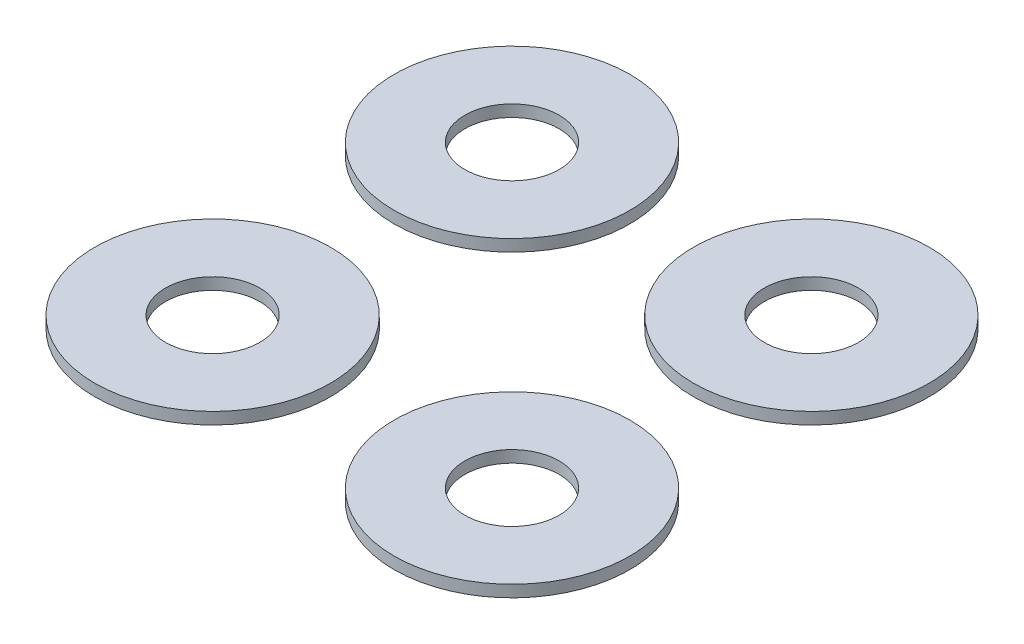
ISO-10303-21;
HEADER;
FILE_DESCRIPTION(('STEP AP214'),'2;1');
FILE_NAME('part.step','',(''),(''),'','','');
FILE_SCHEMA(('AUTOMOTIVE_DESIGN { 1 0 10303 214 1 1 1 1 }'));
ENDSEC;
DATA;
#1=APPLICATION_CONTEXT('core data for automotive mechanical design processes');
#2=APPLICATION_PROTOCOL_DEFINITION('international standard','automotive_design',2000,#1);
#3=PRODUCT_CONTEXT('',#1,'mechanical');
#4=PRODUCT('Part','Part','',(#3));
#5=PRODUCT_RELATED_PRODUCT_CATEGORY('part','',(#4));
#6=PRODUCT_DEFINITION_FORMATION('','',#4);
#7=PRODUCT_DEFINITION_CONTEXT('part definition',#1,'design');
#8=PRODUCT_DEFINITION('design','',#6,#7);
#9=PRODUCT_DEFINITION_SHAPE('','',#8);
#10=(LENGTH_UNIT() NAMED_UNIT(*) SI_UNIT(.MILLI.,.METRE.));
#11=(NAMED_UNIT(*) PLANE_ANGLE_UNIT() SI_UNIT($,.RADIAN.));
#12=(NAMED_UNIT(*) SI_UNIT($,.STERADIAN.) SOLID_ANGLE_UNIT());
#13=UNCERTAINTY_MEASURE_WITH_UNIT(LENGTH_MEASURE(1.E-05),#10,'distance_accuracy_value','');
#14=(GEOMETRIC_REPRESENTATION_CONTEXT(3) GLOBAL_UNCERTAINTY_ASSIGNED_CONTEXT((#13)) GLOBAL_UNIT_ASSIGNED_CONTEXT((#10,
#11,#12)) REPRESENTATION_CONTEXT('',''));
#15=CARTESIAN_POINT('',(0.,0.,0.));
#16=DIRECTION('',(0.,0.,1.));
#17=DIRECTION('',(1.,0.,0.));
#18=AXIS2_PLACEMENT_3D('',#15,#16,#17);
#19=CARTESIAN_POINT('',(2.54,0.1,-2.54));
#20=DIRECTION('',(0.,-1.,0.));
#21=DIRECTION('',(0.,0.,-1.));
#22=AXIS2_PLACEMENT_3D('',#19,#20,#21);
#23=CYLINDRICAL_SURFACE('',#22,1.);
#24=CARTESIAN_POINT('',(2.54,0.1,-2.54));
#25=DIRECTION('',(0.,-1.,0.));
#26=DIRECTION('',(0.,0.,-1.));
#27=AXIS2_PLACEMENT_3D('',#24,#25,#26);
#28=CIRCLE('',#27,1.);
#29=CARTESIAN_POINT('',(2.54,0.1,-3.54));
#30=VERTEX_POINT('',#29);
#31=EDGE_CURVE('P0_E19',#30,#30,#28,.F.);
#32=ORIENTED_EDGE('',*,*,#31,.F.);
#33=EDGE_LOOP('',(#32));
#34=FACE_BOUND('',#33,.T.);
#35=CARTESIAN_POINT('',(2.54,0.,-2.54));
#36=DIRECTION('',(0.,-1.,0.));
#37=DIRECTION('',(0.,0.,-1.));
#38=AXIS2_PLACEMENT_3D('',#35,#36,#37);
#39=CIRCLE('',#38,1.);
#40=CARTESIAN_POINT('',(2.54,0.,-3.54));
#41=VERTEX_POINT('',#40);
#42=EDGE_CURVE('P0_E28',#41,#41,#39,.F.);
#43=ORIENTED_EDGE('',*,*,#42,.T.);
#44=EDGE_LOOP('',(#43));
#45=FACE_BOUND('',#44,.T.);
#46=ADVANCED_FACE('P0_F15',(#34,#45),#23,.T.);
#47=CARTESIAN_POINT('',(1.528,0.1,-3.552));
#48=DIRECTION('',(0.,1.,0.));
#49=DIRECTION('',(0.,0.,1.));
#50=AXIS2_PLACEMENT_3D('',#47,#48,#49);
#51=PLANE('',#50);
#52=CARTESIAN_POINT('',(2.54,0.1,-2.54));
#53=DIRECTION('',(0.,-1.,0.));
#54=DIRECTION('',(0.,0.,-1.));
#55=AXIS2_PLACEMENT_3D('',#52,#53,#54);
#56=CIRCLE('',#55,0.4);
#57=CARTESIAN_POINT('',(2.54,0.1,-2.94));
#58=VERTEX_POINT('',#57);
#59=EDGE_CURVE('P0_E23',#58,#58,#56,.F.);
#60=ORIENTED_EDGE('',*,*,#59,.F.);
#61=EDGE_LOOP('',(#60));
#62=FACE_BOUND('',#61,.T.);
#63=ORIENTED_EDGE('',*,*,#31,.T.);
#64=EDGE_LOOP('',(#63));
#65=FACE_BOUND('',#64,.T.);
#66=ADVANCED_FACE('P0_F36',(#62,#65),#51,.T.);
#67=CARTESIAN_POINT('',(1.528,0.,-3.552));
#68=DIRECTION('',(0.,1.,0.));
#69=DIRECTION('',(0.,0.,1.));
#70=AXIS2_PLACEMENT_3D('',#67,#68,#69);
#71=PLANE('',#70);
#72=CARTESIAN_POINT('',(2.54,0.,-2.54));
#73=DIRECTION('',(0.,-1.,0.));
#74=DIRECTION('',(0.,0.,-1.));
#75=AXIS2_PLACEMENT_3D('',#72,#73,#74);
#76=CIRCLE('',#75,0.4);
#77=CARTESIAN_POINT('',(2.54,0.,-2.94));
#78=VERTEX_POINT('',#77);
#79=EDGE_CURVE('P0_E10',#78,#78,#76,.T.);
#80=ORIENTED_EDGE('',*,*,#79,.F.);
#81=EDGE_LOOP('',(#80));
#82=FACE_BOUND('',#81,.T.);
#83=ORIENTED_EDGE('',*,*,#42,.F.);
#84=EDGE_LOOP('',(#83));
#85=FACE_BOUND('',#84,.T.);
#86=ADVANCED_FACE('P0_F17',(#82,#85),#71,.F.);
#87=CARTESIAN_POINT('',(2.54,0.1,-2.54));
#88=DIRECTION('',(0.,-1.,0.));
#89=DIRECTION('',(0.,0.,-1.));
#90=AXIS2_PLACEMENT_3D('',#87,#88,#89);
#91=CYLINDRICAL_SURFACE('',#90,0.4);
#92=ORIENTED_EDGE('',*,*,#79,.T.);
#93=EDGE_LOOP('',(#92));
#94=FACE_BOUND('',#93,.T.);
#95=ORIENTED_EDGE('',*,*,#59,.T.);
#96=EDGE_LOOP('',(#95));
#97=FACE_BOUND('',#96,.T.);
#98=ADVANCED_FACE('P0_F46',(#94,#97),#91,.F.);
#99=CLOSED_SHELL('',(#46,#66,#86,#98));
#100=MANIFOLD_SOLID_BREP('P0_B1',#99);
#101=CARTESIAN_POINT('',(0.,0.1,-2.54));
#102=DIRECTION('',(0.,-1.,0.));
#103=DIRECTION('',(0.,0.,-1.));
#104=AXIS2_PLACEMENT_3D('',#101,#102,#103);
#105=CYLINDRICAL_SURFACE('',#104,1.);
#106=CARTESIAN_POINT('',(0.,0.1,-2.54));
#107=DIRECTION('',(0.,-1.,0.));
#108=DIRECTION('',(0.,0.,-1.));
#109=AXIS2_PLACEMENT_3D('',#106,#107,#108);
#110=CIRCLE('',#109,1.);
#111=CARTESIAN_POINT('',(0.,0.1,-3.54));
#112=VERTEX_POINT('',#111);
#113=EDGE_CURVE('P1_E19',#112,#112,#110,.F.);
#114=ORIENTED_EDGE('',*,*,#113,.F.);
#115=EDGE_LOOP('',(#114));
#116=FACE_BOUND('',#115,.T.);
#117=CARTESIAN_POINT('',(0.,0.,-2.54));
#118=DIRECTION('',(0.,-1.,0.));
#119=DIRECTION('',(0.,0.,-1.));
#120=AXIS2_PLACEMENT_3D('',#117,#118,#119);
#121=CIRCLE('',#120,1.);
#122=CARTESIAN_POINT('',(0.,0.,-3.54));
#123=VERTEX_POINT('',#122);
#124=EDGE_CURVE('P1_E28',#123,#123,#121,.F.);
#125=ORIENTED_EDGE('',*,*,#124,.T.);
#126=EDGE_LOOP('',(#125));
#127=FACE_BOUND('',#126,.T.);
#128=ADVANCED_FACE('P1_F15',(#116,#127),#105,.T.);
#129=CARTESIAN_POINT('',(-1.012,0.1,-3.552));
#130=DIRECTION('',(0.,1.,0.));
#131=DIRECTION('',(0.,0.,1.));
#132=AXIS2_PLACEMENT_3D('',#129,#130,#131);
#133=PLANE('',#132);
#134=CARTESIAN_POINT('',(0.,0.1,-2.54));
#135=DIRECTION('',(0.,-1.,0.));
#136=DIRECTION('',(0.,0.,-1.));
#137=AXIS2_PLACEMENT_3D('',#134,#135,#136);
#138=CIRCLE('',#137,0.4);
#139=CARTESIAN_POINT('',(0.,0.1,-2.94));
#140=VERTEX_POINT('',#139);
#141=EDGE_CURVE('P1_E23',#140,#140,#138,.F.);
#142=ORIENTED_EDGE('',*,*,#141,.F.);
#143=EDGE_LOOP('',(#142));
#144=FACE_BOUND('',#143,.T.);
#145=ORIENTED_EDGE('',*,*,#113,.T.);
#146=EDGE_LOOP('',(#145));
#147=FACE_BOUND('',#146,.T.);
#148=ADVANCED_FACE('P1_F36',(#144,#147),#133,.T.);
#149=CARTESIAN_POINT('',(-1.012,0.,-3.552));
#150=DIRECTION('',(0.,1.,0.));
#151=DIRECTION('',(0.,0.,1.));
#152=AXIS2_PLACEMENT_3D('',#149,#150,#151);
#153=PLANE('',#152);
#154=CARTESIAN_POINT('',(0.,0.,-2.54));
#155=DIRECTION('',(0.,-1.,0.));
#156=DIRECTION('',(0.,0.,-1.));
#157=AXIS2_PLACEMENT_3D('',#154,#155,#156);
#158=CIRCLE('',#157,0.4);
#159=CARTESIAN_POINT('',(0.,0.,-2.94));
#160=VERTEX_POINT('',#159);
#161=EDGE_CURVE('P1_E10',#160,#160,#158,.T.);
#162=ORIENTED_EDGE('',*,*,#161,.F.);
#163=EDGE_LOOP('',(#162));
#164=FACE_BOUND('',#163,.T.);
#165=ORIENTED_EDGE('',*,*,#124,.F.);
#166=EDGE_LOOP('',(#165));
#167=FACE_BOUND('',#166,.T.);
#168=ADVANCED_FACE('P1_F17',(#164,#167),#153,.F.);
#169=CARTESIAN_POINT('',(0.,0.1,-2.54));
#170=DIRECTION('',(0.,-1.,0.));
#171=DIRECTION('',(0.,0.,-1.));
#172=AXIS2_PLACEMENT_3D('',#169,#170,#171);
#173=CYLINDRICAL_SURFACE('',#172,0.4);
#174=ORIENTED_EDGE('',*,*,#161,.T.);
#175=EDGE_LOOP('',(#174));
#176=FACE_BOUND('',#175,.T.);
#177=ORIENTED_EDGE('',*,*,#141,.T.);
#178=EDGE_LOOP('',(#177));
#179=FACE_BOUND('',#178,.T.);
#180=ADVANCED_FACE('P1_F46',(#176,#179),#173,.F.);
#181=CLOSED_SHELL('',(#128,#148,#168,#180));
#182=MANIFOLD_SOLID_BREP('P1_B1',#181);
#183=CARTESIAN_POINT('',(0.,0.1,0.));
#184=DIRECTION('',(0.,-1.,0.));
#185=DIRECTION('',(0.,0.,-1.));
#186=AXIS2_PLACEMENT_3D('',#183,#184,#185);
#187=CYLINDRICAL_SURFACE('',#186,1.);
#188=CARTESIAN_POINT('',(0.,0.1,0.));
#189=DIRECTION('',(0.,-1.,0.));
#190=DIRECTION('',(0.,0.,-1.));
#191=AXIS2_PLACEMENT_3D('',#188,#189,#190);
#192=CIRCLE('',#191,1.);
#193=CARTESIAN_POINT('',(0.,0.1,-1.));
#194=VERTEX_POINT('',#193);
#195=EDGE_CURVE('P2_E19',#194,#194,#192,.F.);
#196=ORIENTED_EDGE('',*,*,#195,.F.);
#197=EDGE_LOOP('',(#196));
#198=FACE_BOUND('',#197,.T.);
#199=CARTESIAN_POINT('',(0.,0.,0.));
#200=DIRECTION('',(0.,-1.,0.));
#201=DIRECTION('',(0.,0.,-1.));
#202=AXIS2_PLACEMENT_3D('',#199,#200,#201);
#203=CIRCLE('',#202,1.);
#204=CARTESIAN_POINT('',(0.,0.,-1.));
#205=VERTEX_POINT('',#204);
#206=EDGE_CURVE('P2_E28',#205,#205,#203,.F.);
#207=ORIENTED_EDGE('',*,*,#206,.T.);
#208=EDGE_LOOP('',(#207));
#209=FACE_BOUND('',#208,.T.);
#210=ADVANCED_FACE('P2_F15',(#198,#209),#187,.T.);
#211=CARTESIAN_POINT('',(-1.012,0.1,-1.012));
#212=DIRECTION('',(0.,1.,0.));
#213=DIRECTION('',(0.,0.,1.));
#214=AXIS2_PLACEMENT_3D('',#211,#212,#213);
#215=PLANE('',#214);
#216=CARTESIAN_POINT('',(0.,0.1,0.));
#217=DIRECTION('',(0.,-1.,0.));
#218=DIRECTION('',(0.,0.,-1.));
#219=AXIS2_PLACEMENT_3D('',#216,#217,#218);
#220=CIRCLE('',#219,0.4);
#221=CARTESIAN_POINT('',(0.,0.1,-0.4));
#222=VERTEX_POINT('',#221);
#223=EDGE_CURVE('P2_E23',#222,#222,#220,.F.);
#224=ORIENTED_EDGE('',*,*,#223,.F.);
#225=EDGE_LOOP('',(#224));
#226=FACE_BOUND('',#225,.T.);
#227=ORIENTED_EDGE('',*,*,#195,.T.);
#228=EDGE_LOOP('',(#227));
#229=FACE_BOUND('',#228,.T.);
#230=ADVANCED_FACE('P2_F36',(#226,#229),#215,.T.);
#231=CARTESIAN_POINT('',(-1.012,0.,-1.012));
#232=DIRECTION('',(0.,1.,0.));
#233=DIRECTION('',(0.,0.,1.));
#234=AXIS2_PLACEMENT_3D('',#231,#232,#233);
#235=PLANE('',#234);
#236=CARTESIAN_POINT('',(0.,0.,0.));
#237=DIRECTION('',(0.,-1.,0.));
#238=DIRECTION('',(0.,0.,-1.));
#239=AXIS2_PLACEMENT_3D('',#236,#237,#238);
#240=CIRCLE('',#239,0.4);
#241=CARTESIAN_POINT('',(0.,0.,-0.4));
#242=VERTEX_POINT('',#241);
#243=EDGE_CURVE('P2_E10',#242,#242,#240,.T.);
#244=ORIENTED_EDGE('',*,*,#243,.F.);
#245=EDGE_LOOP('',(#244));
#246=FACE_BOUND('',#245,.T.);
#247=ORIENTED_EDGE('',*,*,#206,.F.);
#248=EDGE_LOOP('',(#247));
#249=FACE_BOUND('',#248,.T.);
#250=ADVANCED_FACE('P2_F17',(#246,#249),#235,.F.);
#251=CARTESIAN_POINT('',(0.,0.1,0.));
#252=DIRECTION('',(0.,-1.,0.));
#253=DIRECTION('',(0.,0.,-1.));
#254=AXIS2_PLACEMENT_3D('',#251,#252,#253);
#255=CYLINDRICAL_SURFACE('',#254,0.4);
#256=ORIENTED_EDGE('',*,*,#243,.T.);
#257=EDGE_LOOP('',(#256));
#258=FACE_BOUND('',#257,.T.);
#259=ORIENTED_EDGE('',*,*,#223,.T.);
#260=EDGE_LOOP('',(#259));
#261=FACE_BOUND('',#260,.T.);
#262=ADVANCED_FACE('P2_F46',(#258,#261),#255,.F.);
#263=CLOSED_SHELL('',(#210,#230,#250,#262));
#264=MANIFOLD_SOLID_BREP('P2_B1',#263);
#265=CARTESIAN_POINT('',(2.54,0.1,0.));
#266=DIRECTION('',(0.,-1.,0.));
#267=DIRECTION('',(0.,0.,-1.));
#268=AXIS2_PLACEMENT_3D('',#265,#266,#267);
#269=CYLINDRICAL_SURFACE('',#268,1.);
#270=CARTESIAN_POINT('',(2.54,0.1,0.));
#271=DIRECTION('',(0.,-1.,0.));
#272=DIRECTION('',(0.,0.,-1.));
#273=AXIS2_PLACEMENT_3D('',#270,#271,#272);
#274=CIRCLE('',#273,1.);
#275=CARTESIAN_POINT('',(2.54,0.1,-1.));
#276=VERTEX_POINT('',#275);
#277=EDGE_CURVE('P3_E19',#276,#276,#274,.F.);
#278=ORIENTED_EDGE('',*,*,#277,.F.);
#279=EDGE_LOOP('',(#278));
#280=FACE_BOUND('',#279,.T.);
#281=CARTESIAN_POINT('',(2.54,0.,0.));
#282=DIRECTION('',(0.,-1.,0.));
#283=DIRECTION('',(0.,0.,-1.));
#284=AXIS2_PLACEMENT_3D('',#281,#282,#283);
#285=CIRCLE('',#284,1.);
#286=CARTESIAN_POINT('',(2.54,0.,-1.));
#287=VERTEX_POINT('',#286);
#288=EDGE_CURVE('P3_E28',#287,#287,#285,.F.);
#289=ORIENTED_EDGE('',*,*,#288,.T.);
#290=EDGE_LOOP('',(#289));
#291=FACE_BOUND('',#290,.T.);
#292=ADVANCED_FACE('P3_F15',(#280,#291),#269,.T.);
#293=CARTESIAN_POINT('',(1.528,0.1,-1.012));
#294=DIRECTION('',(0.,1.,0.));
#295=DIRECTION('',(0.,0.,1.));
#296=AXIS2_PLACEMENT_3D('',#293,#294,#295);
#297=PLANE('',#296);
#298=CARTESIAN_POINT('',(2.54,0.1,0.));
#299=DIRECTION('',(0.,-1.,0.));
#300=DIRECTION('',(0.,0.,-1.));
#301=AXIS2_PLACEMENT_3D('',#298,#299,#300);
#302=CIRCLE('',#301,0.4);
#303=CARTESIAN_POINT('',(2.54,0.1,-0.4));
#304=VERTEX_POINT('',#303);
#305=EDGE_CURVE('P3_E23',#304,#304,#302,.F.);
#306=ORIENTED_EDGE('',*,*,#305,.F.);
#307=EDGE_LOOP('',(#306));
#308=FACE_BOUND('',#307,.T.);
#309=ORIENTED_EDGE('',*,*,#277,.T.);
#310=EDGE_LOOP('',(#309));
#311=FACE_BOUND('',#310,.T.);
#312=ADVANCED_FACE('P3_F36',(#308,#311),#297,.T.);
#313=CARTESIAN_POINT('',(1.528,0.,-1.012));
#314=DIRECTION('',(0.,1.,0.));
#315=DIRECTION('',(0.,0.,1.));
#316=AXIS2_PLACEMENT_3D('',#313,#314,#315);
#317=PLANE('',#316);
#318=CARTESIAN_POINT('',(2.54,0.,0.));
#319=DIRECTION('',(0.,-1.,0.));
#320=DIRECTION('',(0.,0.,-1.));
#321=AXIS2_PLACEMENT_3D('',#318,#319,#320);
#322=CIRCLE('',#321,0.4);
#323=CARTESIAN_POINT('',(2.54,0.,-0.4));
#324=VERTEX_POINT('',#323);
#325=EDGE_CURVE('P3_E10',#324,#324,#322,.T.);
#326=ORIENTED_EDGE('',*,*,#325,.F.);
#327=EDGE_LOOP('',(#326));
#328=FACE_BOUND('',#327,.T.);
#329=ORIENTED_EDGE('',*,*,#288,.F.);
#330=EDGE_LOOP('',(#329));
#331=FACE_BOUND('',#330,.T.);
#332=ADVANCED_FACE('P3_F17',(#328,#331),#317,.F.);
#333=CARTESIAN_POINT('',(2.54,0.1,0.));
#334=DIRECTION('',(0.,-1.,0.));
#335=DIRECTION('',(0.,0.,-1.));
#336=AXIS2_PLACEMENT_3D('',#333,#334,#335);
#337=CYLINDRICAL_SURFACE('',#336,0.4);
#338=ORIENTED_EDGE('',*,*,#325,.T.);
#339=EDGE_LOOP('',(#338));
#340=FACE_BOUND('',#339,.T.);
#341=ORIENTED_EDGE('',*,*,#305,.T.);
#342=EDGE_LOOP('',(#341));
#343=FACE_BOUND('',#342,.T.);
#344=ADVANCED_FACE('P3_F46',(#340,#343),#337,.F.);
#345=CLOSED_SHELL('',(#292,#312,#332,#344));
#346=MANIFOLD_SOLID_BREP('P3_B1',#345);
#347=ADVANCED_BREP_SHAPE_REPRESENTATION('',(#18,#100,#182,#264,#346),#14);
#348=SHAPE_DEFINITION_REPRESENTATION(#9,#347);
ENDSEC;
END-ISO-10303-21;
